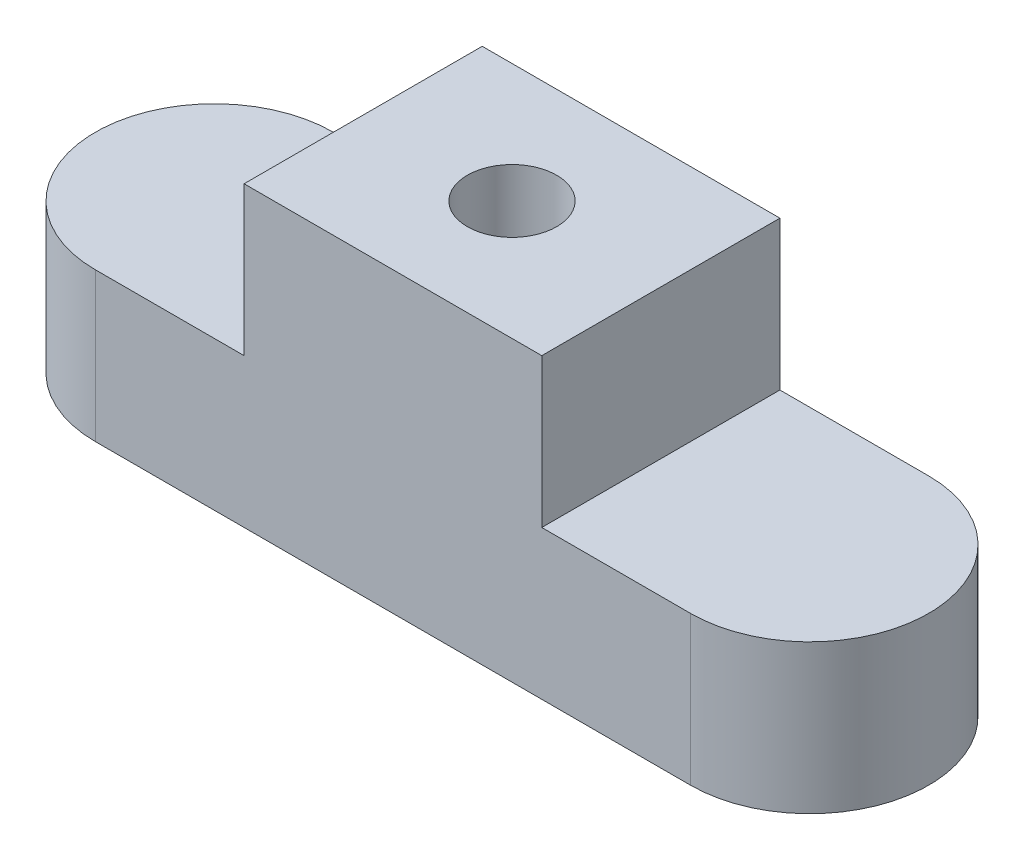
ISO-10303-21;
HEADER;
FILE_DESCRIPTION(('STEP AP214'),'2;1');
FILE_NAME('part.step','',(''),(''),'','','');
FILE_SCHEMA(('AUTOMOTIVE_DESIGN { 1 0 10303 214 1 1 1 1 }'));
ENDSEC;
DATA;
#1=APPLICATION_CONTEXT('core data for automotive mechanical design processes');
#2=APPLICATION_PROTOCOL_DEFINITION('international standard','automotive_design',2000,#1);
#3=PRODUCT_CONTEXT('',#1,'mechanical');
#4=PRODUCT('Part','Part','',(#3));
#5=PRODUCT_RELATED_PRODUCT_CATEGORY('part','',(#4));
#6=PRODUCT_DEFINITION_FORMATION('','',#4);
#7=PRODUCT_DEFINITION_CONTEXT('part definition',#1,'design');
#8=PRODUCT_DEFINITION('design','',#6,#7);
#9=PRODUCT_DEFINITION_SHAPE('','',#8);
#10=(LENGTH_UNIT() NAMED_UNIT(*) SI_UNIT(.MILLI.,.METRE.));
#11=(NAMED_UNIT(*) PLANE_ANGLE_UNIT() SI_UNIT($,.RADIAN.));
#12=(NAMED_UNIT(*) SI_UNIT($,.STERADIAN.) SOLID_ANGLE_UNIT());
#13=UNCERTAINTY_MEASURE_WITH_UNIT(LENGTH_MEASURE(1.E-05),#10,'distance_accuracy_value','');
#14=(GEOMETRIC_REPRESENTATION_CONTEXT(3) GLOBAL_UNCERTAINTY_ASSIGNED_CONTEXT((#13)) GLOBAL_UNIT_ASSIGNED_CONTEXT((#10,
#11,#12)) REPRESENTATION_CONTEXT('',''));
#15=CARTESIAN_POINT('',(0.,0.,0.));
#16=DIRECTION('',(0.,0.,1.));
#17=DIRECTION('',(1.,0.,0.));
#18=AXIS2_PLACEMENT_3D('',#15,#16,#17);
#19=CARTESIAN_POINT('',(-10.,5.,0.));
#20=DIRECTION('',(0.,1.,0.));
#21=DIRECTION('',(0.,0.,1.));
#22=AXIS2_PLACEMENT_3D('',#19,#20,#21);
#23=PLANE('',#22);
#24=DIRECTION('',(0.,0.,1.));
#25=VECTOR('',#24,1.);
#26=CARTESIAN_POINT('',(-5.,5.,4.));
#27=LINE('',#26,#25);
#28=CARTESIAN_POINT('',(-5.,5.,-4.));
#29=VERTEX_POINT('',#28);
#30=CARTESIAN_POINT('',(-5.,5.,4.));
#31=VERTEX_POINT('',#30);
#32=EDGE_CURVE('E48',#29,#31,#27,.T.);
#33=ORIENTED_EDGE('',*,*,#32,.F.);
#34=DIRECTION('',(-1.,0.,0.));
#35=VECTOR('',#34,1.);
#36=CARTESIAN_POINT('',(10.,5.,-4.));
#37=LINE('',#36,#35);
#38=CARTESIAN_POINT('',(-10.,5.,-4.));
#39=VERTEX_POINT('',#38);
#40=EDGE_CURVE('E145',#29,#39,#37,.T.);
#41=ORIENTED_EDGE('',*,*,#40,.T.);
#42=CARTESIAN_POINT('',(-10.,5.,0.));
#43=DIRECTION('',(0.,1.,0.));
#44=DIRECTION('',(0.,0.,1.));
#45=AXIS2_PLACEMENT_3D('',#42,#43,#44);
#46=CIRCLE('',#45,4.);
#47=CARTESIAN_POINT('',(-10.,5.,4.));
#48=VERTEX_POINT('',#47);
#49=EDGE_CURVE('E140',#39,#48,#46,.T.);
#50=ORIENTED_EDGE('',*,*,#49,.T.);
#51=DIRECTION('',(1.,0.,0.));
#52=VECTOR('',#51,1.);
#53=CARTESIAN_POINT('',(10.,5.,4.));
#54=LINE('',#53,#52);
#55=EDGE_CURVE('E295',#48,#31,#54,.T.);
#56=ORIENTED_EDGE('',*,*,#55,.T.);
#57=EDGE_LOOP('',(#33,#41,#50,#56));
#58=FACE_BOUND('',#57,.T.);
#59=ADVANCED_FACE('F31',(#58),#23,.T.);
#60=CARTESIAN_POINT('',(-10.,5.,0.));
#61=DIRECTION('',(0.,-1.,0.));
#62=DIRECTION('',(0.,0.,-1.));
#63=AXIS2_PLACEMENT_3D('',#60,#61,#62);
#64=CYLINDRICAL_SURFACE('',#63,4.);
#65=CARTESIAN_POINT('',(-10.,0.,0.));
#66=DIRECTION('',(0.,1.,0.));
#67=DIRECTION('',(0.,0.,1.));
#68=AXIS2_PLACEMENT_3D('',#65,#66,#67);
#69=CIRCLE('',#68,4.);
#70=CARTESIAN_POINT('',(-10.,0.,-4.));
#71=VERTEX_POINT('',#70);
#72=CARTESIAN_POINT('',(-10.,0.,4.));
#73=VERTEX_POINT('',#72);
#74=EDGE_CURVE('E119',#71,#73,#69,.T.);
#75=ORIENTED_EDGE('',*,*,#74,.T.);
#76=DIRECTION('',(0.,-1.,0.));
#77=VECTOR('',#76,1.);
#78=CARTESIAN_POINT('',(-10.,5.,4.));
#79=LINE('',#78,#77);
#80=EDGE_CURVE('E11',#48,#73,#79,.T.);
#81=ORIENTED_EDGE('',*,*,#80,.F.);
#82=ORIENTED_EDGE('',*,*,#49,.F.);
#83=DIRECTION('',(0.,-1.,0.));
#84=VECTOR('',#83,1.);
#85=CARTESIAN_POINT('',(-10.,5.,-4.));
#86=LINE('',#85,#84);
#87=EDGE_CURVE('E280',#39,#71,#86,.T.);
#88=ORIENTED_EDGE('',*,*,#87,.T.);
#89=EDGE_LOOP('',(#75,#81,#82,#88));
#90=FACE_BOUND('',#89,.T.);
#91=ADVANCED_FACE('F33',(#90),#64,.T.);
#92=CARTESIAN_POINT('',(10.,5.,4.));
#93=DIRECTION('',(0.,0.,-1.));
#94=DIRECTION('',(-1.,0.,0.));
#95=AXIS2_PLACEMENT_3D('',#92,#93,#94);
#96=PLANE('',#95);
#97=DIRECTION('',(1.,0.,0.));
#98=VECTOR('',#97,1.);
#99=CARTESIAN_POINT('',(10.,0.,4.));
#100=LINE('',#99,#98);
#101=CARTESIAN_POINT('',(10.,0.,4.));
#102=VERTEX_POINT('',#101);
#103=EDGE_CURVE('E122',#73,#102,#100,.T.);
#104=ORIENTED_EDGE('',*,*,#103,.T.);
#105=DIRECTION('',(0.,-1.,0.));
#106=VECTOR('',#105,1.);
#107=CARTESIAN_POINT('',(10.,5.,4.));
#108=LINE('',#107,#106);
#109=CARTESIAN_POINT('',(10.,5.,4.));
#110=VERTEX_POINT('',#109);
#111=EDGE_CURVE('E40',#110,#102,#108,.T.);
#112=ORIENTED_EDGE('',*,*,#111,.F.);
#113=CARTESIAN_POINT('',(5.,5.,4.));
#114=VERTEX_POINT('',#113);
#115=EDGE_CURVE('E297',#114,#110,#54,.T.);
#116=ORIENTED_EDGE('',*,*,#115,.F.);
#117=DIRECTION('',(0.,-1.,0.));
#118=VECTOR('',#117,1.);
#119=CARTESIAN_POINT('',(5.,10.,4.));
#120=LINE('',#119,#118);
#121=CARTESIAN_POINT('',(5.,10.,4.));
#122=VERTEX_POINT('',#121);
#123=EDGE_CURVE('E104',#122,#114,#120,.T.);
#124=ORIENTED_EDGE('',*,*,#123,.F.);
#125=DIRECTION('',(1.,0.,0.));
#126=VECTOR('',#125,1.);
#127=CARTESIAN_POINT('',(5.,10.,4.));
#128=LINE('',#127,#126);
#129=CARTESIAN_POINT('',(-5.,10.,4.));
#130=VERTEX_POINT('',#129);
#131=EDGE_CURVE('E98',#130,#122,#128,.T.);
#132=ORIENTED_EDGE('',*,*,#131,.F.);
#133=DIRECTION('',(0.,-1.,0.));
#134=VECTOR('',#133,1.);
#135=CARTESIAN_POINT('',(-5.,10.,4.));
#136=LINE('',#135,#134);
#137=EDGE_CURVE('E102',#130,#31,#136,.T.);
#138=ORIENTED_EDGE('',*,*,#137,.T.);
#139=ORIENTED_EDGE('',*,*,#55,.F.);
#140=ORIENTED_EDGE('',*,*,#80,.T.);
#141=EDGE_LOOP('',(#104,#112,#116,#124,#132,#138,#139,#140));
#142=FACE_BOUND('',#141,.T.);
#143=ADVANCED_FACE('F100',(#142),#96,.F.);
#144=CARTESIAN_POINT('',(10.,5.,0.));
#145=DIRECTION('',(0.,-1.,0.));
#146=DIRECTION('',(0.,0.,-1.));
#147=AXIS2_PLACEMENT_3D('',#144,#145,#146);
#148=CYLINDRICAL_SURFACE('',#147,4.);
#149=CARTESIAN_POINT('',(10.,0.,0.));
#150=DIRECTION('',(0.,1.,0.));
#151=DIRECTION('',(0.,0.,1.));
#152=AXIS2_PLACEMENT_3D('',#149,#150,#151);
#153=CIRCLE('',#152,4.);
#154=CARTESIAN_POINT('',(10.,0.,-4.));
#155=VERTEX_POINT('',#154);
#156=EDGE_CURVE('E286',#102,#155,#153,.T.);
#157=ORIENTED_EDGE('',*,*,#156,.T.);
#158=DIRECTION('',(0.,-1.,0.));
#159=VECTOR('',#158,1.);
#160=CARTESIAN_POINT('',(10.,5.,-4.));
#161=LINE('',#160,#159);
#162=CARTESIAN_POINT('',(10.,5.,-4.));
#163=VERTEX_POINT('',#162);
#164=EDGE_CURVE('E283',#163,#155,#161,.T.);
#165=ORIENTED_EDGE('',*,*,#164,.F.);
#166=CARTESIAN_POINT('',(10.,5.,0.));
#167=DIRECTION('',(0.,1.,0.));
#168=DIRECTION('',(0.,0.,1.));
#169=AXIS2_PLACEMENT_3D('',#166,#167,#168);
#170=CIRCLE('',#169,4.);
#171=EDGE_CURVE('E296',#110,#163,#170,.T.);
#172=ORIENTED_EDGE('',*,*,#171,.F.);
#173=ORIENTED_EDGE('',*,*,#111,.T.);
#174=EDGE_LOOP('',(#157,#165,#172,#173));
#175=FACE_BOUND('',#174,.T.);
#176=ADVANCED_FACE('F194',(#175),#148,.T.);
#177=CARTESIAN_POINT('',(10.,5.,-4.));
#178=DIRECTION('',(0.,0.,1.));
#179=DIRECTION('',(1.,0.,0.));
#180=AXIS2_PLACEMENT_3D('',#177,#178,#179);
#181=PLANE('',#180);
#182=DIRECTION('',(-1.,0.,0.));
#183=VECTOR('',#182,1.);
#184=CARTESIAN_POINT('',(10.,0.,-4.));
#185=LINE('',#184,#183);
#186=EDGE_CURVE('E278',#155,#71,#185,.T.);
#187=ORIENTED_EDGE('',*,*,#186,.T.);
#188=ORIENTED_EDGE('',*,*,#87,.F.);
#189=ORIENTED_EDGE('',*,*,#40,.F.);
#190=DIRECTION('',(0.,-1.,0.));
#191=VECTOR('',#190,1.);
#192=CARTESIAN_POINT('',(-5.,10.,-4.));
#193=LINE('',#192,#191);
#194=CARTESIAN_POINT('',(-5.,10.,-4.));
#195=VERTEX_POINT('',#194);
#196=EDGE_CURVE('E133',#195,#29,#193,.T.);
#197=ORIENTED_EDGE('',*,*,#196,.F.);
#198=DIRECTION('',(-1.,0.,0.));
#199=VECTOR('',#198,1.);
#200=CARTESIAN_POINT('',(5.,10.,-4.));
#201=LINE('',#200,#199);
#202=CARTESIAN_POINT('',(5.,10.,-4.));
#203=VERTEX_POINT('',#202);
#204=EDGE_CURVE('E113',#203,#195,#201,.T.);
#205=ORIENTED_EDGE('',*,*,#204,.F.);
#206=DIRECTION('',(0.,-1.,0.));
#207=VECTOR('',#206,1.);
#208=CARTESIAN_POINT('',(5.,10.,-4.));
#209=LINE('',#208,#207);
#210=CARTESIAN_POINT('',(5.,5.,-4.));
#211=VERTEX_POINT('',#210);
#212=EDGE_CURVE('E124',#203,#211,#209,.T.);
#213=ORIENTED_EDGE('',*,*,#212,.T.);
#214=EDGE_CURVE('E290',#163,#211,#37,.T.);
#215=ORIENTED_EDGE('',*,*,#214,.F.);
#216=ORIENTED_EDGE('',*,*,#164,.T.);
#217=EDGE_LOOP('',(#187,#188,#189,#197,#205,#213,#215,#216));
#218=FACE_BOUND('',#217,.T.);
#219=ADVANCED_FACE('F188',(#218),#181,.F.);
#220=DIRECTION('',(0.,0.,-1.));
#221=VECTOR('',#220,1.);
#222=CARTESIAN_POINT('',(5.,5.,4.));
#223=LINE('',#222,#221);
#224=EDGE_CURVE('E56',#114,#211,#223,.T.);
#225=ORIENTED_EDGE('',*,*,#224,.F.);
#226=ORIENTED_EDGE('',*,*,#115,.T.);
#227=ORIENTED_EDGE('',*,*,#171,.T.);
#228=ORIENTED_EDGE('',*,*,#214,.T.);
#229=EDGE_LOOP('',(#225,#226,#227,#228));
#230=FACE_BOUND('',#229,.T.);
#231=ADVANCED_FACE('F179',(#230),#23,.T.);
#232=CARTESIAN_POINT('',(-10.,0.,0.));
#233=DIRECTION('',(0.,1.,0.));
#234=DIRECTION('',(0.,0.,1.));
#235=AXIS2_PLACEMENT_3D('',#232,#233,#234);
#236=PLANE('',#235);
#237=ORIENTED_EDGE('',*,*,#74,.F.);
#238=ORIENTED_EDGE('',*,*,#186,.F.);
#239=ORIENTED_EDGE('',*,*,#156,.F.);
#240=ORIENTED_EDGE('',*,*,#103,.F.);
#241=EDGE_LOOP('',(#237,#238,#239,#240));
#242=FACE_BOUND('',#241,.T.);
#243=ADVANCED_FACE('F187',(#242),#236,.F.);
#244=CARTESIAN_POINT('',(-5.,10.,4.));
#245=DIRECTION('',(1.,0.,0.));
#246=DIRECTION('',(0.,0.,-1.));
#247=AXIS2_PLACEMENT_3D('',#244,#245,#246);
#248=PLANE('',#247);
#249=ORIENTED_EDGE('',*,*,#32,.T.);
#250=ORIENTED_EDGE('',*,*,#137,.F.);
#251=DIRECTION('',(0.,0.,1.));
#252=VECTOR('',#251,1.);
#253=CARTESIAN_POINT('',(-5.,10.,4.));
#254=LINE('',#253,#252);
#255=EDGE_CURVE('E108',#195,#130,#254,.T.);
#256=ORIENTED_EDGE('',*,*,#255,.F.);
#257=ORIENTED_EDGE('',*,*,#196,.T.);
#258=EDGE_LOOP('',(#249,#250,#256,#257));
#259=FACE_BOUND('',#258,.T.);
#260=ADVANCED_FACE('F118',(#259),#248,.F.);
#261=CARTESIAN_POINT('',(5.,10.,4.));
#262=DIRECTION('',(-1.,0.,0.));
#263=DIRECTION('',(0.,0.,1.));
#264=AXIS2_PLACEMENT_3D('',#261,#262,#263);
#265=PLANE('',#264);
#266=ORIENTED_EDGE('',*,*,#224,.T.);
#267=ORIENTED_EDGE('',*,*,#212,.F.);
#268=DIRECTION('',(0.,0.,-1.));
#269=VECTOR('',#268,1.);
#270=CARTESIAN_POINT('',(5.,10.,4.));
#271=LINE('',#270,#269);
#272=EDGE_CURVE('E107',#122,#203,#271,.T.);
#273=ORIENTED_EDGE('',*,*,#272,.F.);
#274=ORIENTED_EDGE('',*,*,#123,.T.);
#275=EDGE_LOOP('',(#266,#267,#273,#274));
#276=FACE_BOUND('',#275,.T.);
#277=ADVANCED_FACE('F170',(#276),#265,.F.);
#278=CARTESIAN_POINT('',(-5.,10.,-4.));
#279=DIRECTION('',(0.,1.,0.));
#280=DIRECTION('',(0.,0.,1.));
#281=AXIS2_PLACEMENT_3D('',#278,#279,#280);
#282=PLANE('',#281);
#283=CARTESIAN_POINT('',(0.,10.,0.));
#284=DIRECTION('',(0.,1.,0.));
#285=DIRECTION('',(0.,0.,1.));
#286=AXIS2_PLACEMENT_3D('',#283,#284,#285);
#287=CIRCLE('',#286,1.5);
#288=CARTESIAN_POINT('',(0.,10.,1.5));
#289=VERTEX_POINT('',#288);
#290=EDGE_CURVE('E155',#289,#289,#287,.T.);
#291=ORIENTED_EDGE('',*,*,#290,.F.);
#292=EDGE_LOOP('',(#291));
#293=FACE_BOUND('',#292,.T.);
#294=ORIENTED_EDGE('',*,*,#255,.T.);
#295=ORIENTED_EDGE('',*,*,#131,.T.);
#296=ORIENTED_EDGE('',*,*,#272,.T.);
#297=ORIENTED_EDGE('',*,*,#204,.T.);
#298=EDGE_LOOP('',(#294,#295,#296,#297));
#299=FACE_BOUND('',#298,.T.);
#300=ADVANCED_FACE('F111',(#293,#299),#282,.T.);
#301=CARTESIAN_POINT('',(0.,2.,0.));
#302=DIRECTION('',(0.,1.,0.));
#303=DIRECTION('',(0.,0.,1.));
#304=AXIS2_PLACEMENT_3D('',#301,#302,#303);
#305=CYLINDRICAL_SURFACE('',#304,1.5);
#306=CARTESIAN_POINT('',(0.,2.,0.));
#307=DIRECTION('',(0.,1.,0.));
#308=DIRECTION('',(0.,0.,1.));
#309=AXIS2_PLACEMENT_3D('',#306,#307,#308);
#310=CIRCLE('',#309,1.5);
#311=CARTESIAN_POINT('',(0.,2.,1.5));
#312=VERTEX_POINT('',#311);
#313=EDGE_CURVE('E132',#312,#312,#310,.T.);
#314=ORIENTED_EDGE('',*,*,#313,.F.);
#315=EDGE_LOOP('',(#314));
#316=FACE_BOUND('',#315,.T.);
#317=ORIENTED_EDGE('',*,*,#290,.T.);
#318=EDGE_LOOP('',(#317));
#319=FACE_BOUND('',#318,.T.);
#320=ADVANCED_FACE('F163',(#316,#319),#305,.F.);
#321=CARTESIAN_POINT('',(0.,2.,0.));
#322=DIRECTION('',(0.,1.,0.));
#323=DIRECTION('',(0.,0.,1.));
#324=AXIS2_PLACEMENT_3D('',#321,#322,#323);
#325=PLANE('',#324);
#326=ORIENTED_EDGE('',*,*,#313,.T.);
#327=EDGE_LOOP('',(#326));
#328=FACE_BOUND('',#327,.T.);
#329=ADVANCED_FACE('F161',(#328),#325,.T.);
#330=CLOSED_SHELL('',(#59,#91,#143,#176,#219,#231,#243,#260,#277,#300,#320,#329));
#331=MANIFOLD_SOLID_BREP('B2',#330);
#332=ADVANCED_BREP_SHAPE_REPRESENTATION('',(#18,#331),#14);
#333=SHAPE_DEFINITION_REPRESENTATION(#9,#332);
ENDSEC;
END-ISO-10303-21;
